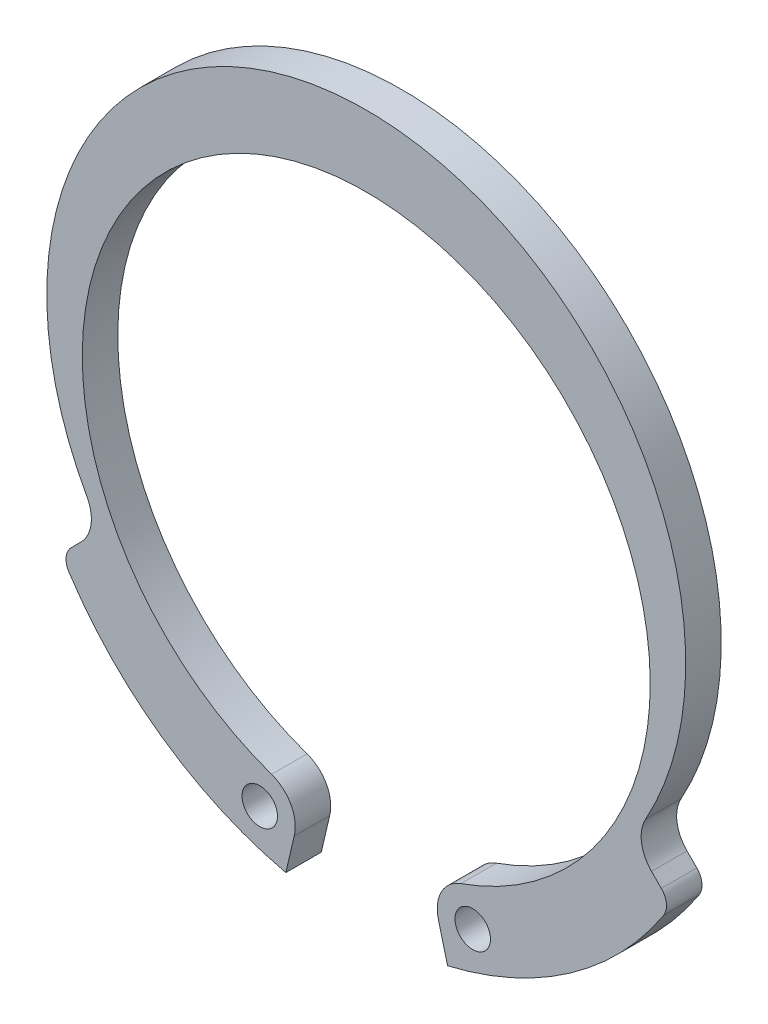
ISO-10303-21;
HEADER;
FILE_DESCRIPTION(('STEP AP214'),'2;1');
FILE_NAME('part.step','',(''),(''),'','','');
FILE_SCHEMA(('AUTOMOTIVE_DESIGN { 1 0 10303 214 1 1 1 1 }'));
ENDSEC;
DATA;
#1=APPLICATION_CONTEXT('core data for automotive mechanical design processes');
#2=APPLICATION_PROTOCOL_DEFINITION('international standard','automotive_design',2000,#1);
#3=PRODUCT_CONTEXT('',#1,'mechanical');
#4=PRODUCT('Part','Part','',(#3));
#5=PRODUCT_RELATED_PRODUCT_CATEGORY('part','',(#4));
#6=PRODUCT_DEFINITION_FORMATION('','',#4);
#7=PRODUCT_DEFINITION_CONTEXT('part definition',#1,'design');
#8=PRODUCT_DEFINITION('design','',#6,#7);
#9=PRODUCT_DEFINITION_SHAPE('','',#8);
#10=(LENGTH_UNIT() NAMED_UNIT(*) SI_UNIT(.MILLI.,.METRE.));
#11=(NAMED_UNIT(*) PLANE_ANGLE_UNIT() SI_UNIT($,.RADIAN.));
#12=(NAMED_UNIT(*) SI_UNIT($,.STERADIAN.) SOLID_ANGLE_UNIT());
#13=UNCERTAINTY_MEASURE_WITH_UNIT(LENGTH_MEASURE(1.E-05),#10,'distance_accuracy_value','');
#14=(GEOMETRIC_REPRESENTATION_CONTEXT(3) GLOBAL_UNCERTAINTY_ASSIGNED_CONTEXT((#13)) GLOBAL_UNIT_ASSIGNED_CONTEXT((#10,
#11,#12)) REPRESENTATION_CONTEXT('',''));
#15=CARTESIAN_POINT('',(0.,0.,0.));
#16=DIRECTION('',(0.,0.,1.));
#17=DIRECTION('',(1.,0.,0.));
#18=AXIS2_PLACEMENT_3D('',#15,#16,#17);
#19=CARTESIAN_POINT('',(-8.74391330389976,-4.85221394147917,1.));
#20=DIRECTION('',(0.,0.,1.));
#21=DIRECTION('',(1.,0.,0.));
#22=AXIS2_PLACEMENT_3D('',#19,#20,#21);
#23=PLANE('',#22);
#24=CARTESIAN_POINT('',(-3.,-9.48528137423857,1.));
#25=DIRECTION('',(0.,0.,1.));
#26=DIRECTION('',(1.,0.,0.));
#27=AXIS2_PLACEMENT_3D('',#24,#25,#26);
#28=CIRCLE('',#27,0.5);
#29=CARTESIAN_POINT('',(-2.5,-9.48528137423857,1.));
#30=VERTEX_POINT('',#29);
#31=EDGE_CURVE('E174',#30,#30,#28,.T.);
#32=ORIENTED_EDGE('',*,*,#31,.F.);
#33=EDGE_LOOP('',(#32));
#34=FACE_BOUND('',#33,.T.);
#35=CARTESIAN_POINT('',(-8.74391330389976,-4.85221394147917,1.));
#36=DIRECTION('',(0.,0.,-1.));
#37=DIRECTION('',(1.,0.,0.));
#38=AXIS2_PLACEMENT_3D('',#35,#36,#37);
#39=CIRCLE('',#38,1.);
#40=CARTESIAN_POINT('',(-7.86952197350978,-4.36699254733125,1.));
#41=VERTEX_POINT('',#40);
#42=CARTESIAN_POINT('',(-8.0368065227132,-5.55932072266571,1.));
#43=VERTEX_POINT('',#42);
#44=EDGE_CURVE('E197',#41,#43,#39,.T.);
#45=ORIENTED_EDGE('',*,*,#44,.T.);
#46=DIRECTION('',(-0.707106781186541,-0.707106781186554,0.));
#47=VECTOR('',#46,1.);
#48=CARTESIAN_POINT('',(-8.0368065227132,-5.55932072266571,1.));
#49=LINE('',#48,#47);
#50=CARTESIAN_POINT('',(-8.31188902824604,-5.83440322819855,1.));
#51=VERTEX_POINT('',#50);
#52=EDGE_CURVE('E115',#43,#51,#49,.T.);
#53=ORIENTED_EDGE('',*,*,#52,.T.);
#54=CARTESIAN_POINT('',(-7.95833563765277,-6.18795661879182,1.));
#55=DIRECTION('',(0.,0.,1.));
#56=DIRECTION('',(1.,0.,0.));
#57=AXIS2_PLACEMENT_3D('',#54,#55,#56);
#58=CIRCLE('',#57,0.500000000000001);
#59=CARTESIAN_POINT('',(-8.37719540805555,-6.46100696714929,1.));
#60=VERTEX_POINT('',#59);
#61=EDGE_CURVE('E230',#51,#60,#58,.T.);
#62=ORIENTED_EDGE('',*,*,#61,.T.);
#63=CARTESIAN_POINT('',(0.,-1.,1.));
#64=DIRECTION('',(0.,0.,1.));
#65=DIRECTION('',(1.,0.,0.));
#66=AXIS2_PLACEMENT_3D('',#63,#64,#65);
#67=CIRCLE('',#66,10.);
#68=CARTESIAN_POINT('',(-2.26550344127932,-10.7399945666079,1.));
#69=VERTEX_POINT('',#68);
#70=EDGE_CURVE('E249',#60,#69,#67,.T.);
#71=ORIENTED_EDGE('',*,*,#70,.T.);
#72=DIRECTION('',(0.226550344127932,0.973999456660791,0.));
#73=VECTOR('',#72,1.);
#74=CARTESIAN_POINT('',(-2.0322874859678,-9.73733789604567,1.));
#75=LINE('',#74,#73);
#76=CARTESIAN_POINT('',(-2.0322874859678,-9.73733789604567,1.));
#77=VERTEX_POINT('',#76);
#78=EDGE_CURVE('E246',#69,#77,#75,.T.);
#79=ORIENTED_EDGE('',*,*,#78,.T.);
#80=CARTESIAN_POINT('',(-3.,-9.48528137423857,1.));
#81=DIRECTION('',(0.,0.,1.));
#82=DIRECTION('',(1.,0.,0.));
#83=AXIS2_PLACEMENT_3D('',#80,#81,#82);
#84=CIRCLE('',#83,1.);
#85=CARTESIAN_POINT('',(-2.66666666666666,-8.54247233265651,1.));
#86=VERTEX_POINT('',#85);
#87=EDGE_CURVE('E248',#77,#86,#84,.T.);
#88=ORIENTED_EDGE('',*,*,#87,.T.);
#89=CARTESIAN_POINT('',(0.,-1.,1.));
#90=DIRECTION('',(0.,0.,-1.));
#91=DIRECTION('',(1.,0.,0.));
#92=AXIS2_PLACEMENT_3D('',#89,#90,#91);
#93=CIRCLE('',#92,8.);
#94=CARTESIAN_POINT('',(2.66666666666667,-8.54247233265651,1.));
#95=VERTEX_POINT('',#94);
#96=EDGE_CURVE('E251',#86,#95,#93,.T.);
#97=ORIENTED_EDGE('',*,*,#96,.T.);
#98=CARTESIAN_POINT('',(3.,-9.48528137423857,1.));
#99=DIRECTION('',(0.,0.,1.));
#100=DIRECTION('',(1.,0.,0.));
#101=AXIS2_PLACEMENT_3D('',#98,#99,#100);
#102=CIRCLE('',#101,1.);
#103=CARTESIAN_POINT('',(2.03228748596781,-9.73733789604567,1.));
#104=VERTEX_POINT('',#103);
#105=EDGE_CURVE('E257',#95,#104,#102,.T.);
#106=ORIENTED_EDGE('',*,*,#105,.T.);
#107=DIRECTION('',(0.252056521807098,-0.967712514032193,0.));
#108=VECTOR('',#107,1.);
#109=CARTESIAN_POINT('',(2.03228748596781,-9.73733789604567,1.));
#110=LINE('',#109,#108);
#111=CARTESIAN_POINT('',(2.29184040400694,-10.7338310835231,1.));
#112=VERTEX_POINT('',#111);
#113=EDGE_CURVE('E259',#104,#112,#110,.T.);
#114=ORIENTED_EDGE('',*,*,#113,.T.);
#115=CARTESIAN_POINT('',(0.,-1.,1.));
#116=DIRECTION('',(0.,0.,1.));
#117=DIRECTION('',(1.,0.,0.));
#118=AXIS2_PLACEMENT_3D('',#115,#116,#117);
#119=CIRCLE('',#118,10.);
#120=CARTESIAN_POINT('',(8.37719540805554,-6.46100696714929,1.));
#121=VERTEX_POINT('',#120);
#122=EDGE_CURVE('E261',#112,#121,#119,.T.);
#123=ORIENTED_EDGE('',*,*,#122,.T.);
#124=CARTESIAN_POINT('',(7.95833563765277,-6.18795661879183,1.));
#125=DIRECTION('',(0.,0.,1.));
#126=DIRECTION('',(-1.,0.,0.));
#127=AXIS2_PLACEMENT_3D('',#124,#125,#126);
#128=CIRCLE('',#127,0.5);
#129=CARTESIAN_POINT('',(8.31188902824605,-5.83440322819856,1.));
#130=VERTEX_POINT('',#129);
#131=EDGE_CURVE('E152',#121,#130,#128,.T.);
#132=ORIENTED_EDGE('',*,*,#131,.T.);
#133=DIRECTION('',(-0.707106781186542,0.707106781186553,0.));
#134=VECTOR('',#133,1.);
#135=CARTESIAN_POINT('',(8.0368065227132,-5.55932072266571,1.));
#136=LINE('',#135,#134);
#137=CARTESIAN_POINT('',(8.0368065227132,-5.55932072266571,1.));
#138=VERTEX_POINT('',#137);
#139=EDGE_CURVE('E146',#130,#138,#136,.T.);
#140=ORIENTED_EDGE('',*,*,#139,.T.);
#141=CARTESIAN_POINT('',(8.74391330389976,-4.85221394147916,1.));
#142=DIRECTION('',(0.,0.,-1.));
#143=DIRECTION('',(-1.,0.,0.));
#144=AXIS2_PLACEMENT_3D('',#141,#142,#143);
#145=CIRCLE('',#144,0.999999999999999);
#146=CARTESIAN_POINT('',(7.86952197350978,-4.36699254733125,1.));
#147=VERTEX_POINT('',#146);
#148=EDGE_CURVE('E150',#138,#147,#145,.T.);
#149=ORIENTED_EDGE('',*,*,#148,.T.);
#150=CARTESIAN_POINT('',(0.,0.,1.));
#151=DIRECTION('',(0.,0.,1.));
#152=DIRECTION('',(1.,0.,0.));
#153=AXIS2_PLACEMENT_3D('',#150,#151,#152);
#154=CIRCLE('',#153,9.);
#155=EDGE_CURVE('E54',#147,#41,#154,.T.);
#156=ORIENTED_EDGE('',*,*,#155,.T.);
#157=EDGE_LOOP('',(#45,#53,#62,#71,#79,#88,#97,#106,#114,#123,#132,#140,#149,#156));
#158=FACE_BOUND('',#157,.T.);
#159=CARTESIAN_POINT('',(3.,-9.48528137423857,1.));
#160=DIRECTION('',(0.,0.,1.));
#161=DIRECTION('',(1.,0.,0.));
#162=AXIS2_PLACEMENT_3D('',#159,#160,#161);
#163=CIRCLE('',#162,0.5);
#164=CARTESIAN_POINT('',(3.5,-9.48528137423857,1.));
#165=VERTEX_POINT('',#164);
#166=EDGE_CURVE('E303',#165,#165,#163,.T.);
#167=ORIENTED_EDGE('',*,*,#166,.F.);
#168=EDGE_LOOP('',(#167));
#169=FACE_BOUND('',#168,.T.);
#170=ADVANCED_FACE('F37',(#34,#158,#169),#23,.T.);
#171=CARTESIAN_POINT('',(-8.74391330389976,-4.85221394147917,0.));
#172=DIRECTION('',(0.,0.,1.));
#173=DIRECTION('',(1.,0.,0.));
#174=AXIS2_PLACEMENT_3D('',#171,#172,#173);
#175=PLANE('',#174);
#176=CARTESIAN_POINT('',(-8.74391330389976,-4.85221394147917,0.));
#177=DIRECTION('',(0.,0.,-1.));
#178=DIRECTION('',(1.,0.,0.));
#179=AXIS2_PLACEMENT_3D('',#176,#177,#178);
#180=CIRCLE('',#179,1.);
#181=CARTESIAN_POINT('',(-7.86952197350978,-4.36699254733125,0.));
#182=VERTEX_POINT('',#181);
#183=CARTESIAN_POINT('',(-8.0368065227132,-5.55932072266571,0.));
#184=VERTEX_POINT('',#183);
#185=EDGE_CURVE('E170',#182,#184,#180,.T.);
#186=ORIENTED_EDGE('',*,*,#185,.F.);
#187=CARTESIAN_POINT('',(0.,0.,0.));
#188=DIRECTION('',(0.,0.,1.));
#189=DIRECTION('',(1.,0.,0.));
#190=AXIS2_PLACEMENT_3D('',#187,#188,#189);
#191=CIRCLE('',#190,9.);
#192=CARTESIAN_POINT('',(7.86952197350978,-4.36699254733125,0.));
#193=VERTEX_POINT('',#192);
#194=EDGE_CURVE('E107',#193,#182,#191,.T.);
#195=ORIENTED_EDGE('',*,*,#194,.F.);
#196=CARTESIAN_POINT('',(8.74391330389976,-4.85221394147916,0.));
#197=DIRECTION('',(0.,0.,-1.));
#198=DIRECTION('',(-1.,0.,0.));
#199=AXIS2_PLACEMENT_3D('',#196,#197,#198);
#200=CIRCLE('',#199,0.999999999999999);
#201=CARTESIAN_POINT('',(8.0368065227132,-5.55932072266571,0.));
#202=VERTEX_POINT('',#201);
#203=EDGE_CURVE('E101',#202,#193,#200,.T.);
#204=ORIENTED_EDGE('',*,*,#203,.F.);
#205=DIRECTION('',(-0.707106781186542,0.707106781186553,0.));
#206=VECTOR('',#205,1.);
#207=CARTESIAN_POINT('',(8.0368065227132,-5.55932072266571,0.));
#208=LINE('',#207,#206);
#209=CARTESIAN_POINT('',(8.31188902824605,-5.83440322819856,0.));
#210=VERTEX_POINT('',#209);
#211=EDGE_CURVE('E160',#210,#202,#208,.T.);
#212=ORIENTED_EDGE('',*,*,#211,.F.);
#213=CARTESIAN_POINT('',(7.95833563765277,-6.18795661879183,0.));
#214=DIRECTION('',(0.,0.,1.));
#215=DIRECTION('',(-1.,0.,0.));
#216=AXIS2_PLACEMENT_3D('',#213,#214,#215);
#217=CIRCLE('',#216,0.5);
#218=CARTESIAN_POINT('',(8.37719540805554,-6.46100696714929,0.));
#219=VERTEX_POINT('',#218);
#220=EDGE_CURVE('E192',#219,#210,#217,.T.);
#221=ORIENTED_EDGE('',*,*,#220,.F.);
#222=CARTESIAN_POINT('',(0.,-1.,0.));
#223=DIRECTION('',(0.,0.,1.));
#224=DIRECTION('',(1.,0.,0.));
#225=AXIS2_PLACEMENT_3D('',#222,#223,#224);
#226=CIRCLE('',#225,10.);
#227=CARTESIAN_POINT('',(2.29184040400694,-10.7338310835231,0.));
#228=VERTEX_POINT('',#227);
#229=EDGE_CURVE('E190',#228,#219,#226,.T.);
#230=ORIENTED_EDGE('',*,*,#229,.F.);
#231=DIRECTION('',(0.252056521807098,-0.967712514032193,0.));
#232=VECTOR('',#231,1.);
#233=CARTESIAN_POINT('',(2.03228748596781,-9.73733789604567,0.));
#234=LINE('',#233,#232);
#235=CARTESIAN_POINT('',(2.03228748596781,-9.73733789604567,0.));
#236=VERTEX_POINT('',#235);
#237=EDGE_CURVE('E188',#236,#228,#234,.T.);
#238=ORIENTED_EDGE('',*,*,#237,.F.);
#239=CARTESIAN_POINT('',(3.,-9.48528137423857,0.));
#240=DIRECTION('',(0.,0.,1.));
#241=DIRECTION('',(1.,0.,0.));
#242=AXIS2_PLACEMENT_3D('',#239,#240,#241);
#243=CIRCLE('',#242,1.);
#244=CARTESIAN_POINT('',(2.66666666666667,-8.54247233265651,0.));
#245=VERTEX_POINT('',#244);
#246=EDGE_CURVE('E186',#245,#236,#243,.T.);
#247=ORIENTED_EDGE('',*,*,#246,.F.);
#248=CARTESIAN_POINT('',(0.,-1.,0.));
#249=DIRECTION('',(0.,0.,-1.));
#250=DIRECTION('',(1.,0.,0.));
#251=AXIS2_PLACEMENT_3D('',#248,#249,#250);
#252=CIRCLE('',#251,8.);
#253=CARTESIAN_POINT('',(-2.66666666666666,-8.54247233265651,0.));
#254=VERTEX_POINT('',#253);
#255=EDGE_CURVE('E184',#254,#245,#252,.T.);
#256=ORIENTED_EDGE('',*,*,#255,.F.);
#257=CARTESIAN_POINT('',(-3.,-9.48528137423857,0.));
#258=DIRECTION('',(0.,0.,1.));
#259=DIRECTION('',(1.,0.,0.));
#260=AXIS2_PLACEMENT_3D('',#257,#258,#259);
#261=CIRCLE('',#260,1.);
#262=CARTESIAN_POINT('',(-2.0322874859678,-9.73733789604567,0.));
#263=VERTEX_POINT('',#262);
#264=EDGE_CURVE('E182',#263,#254,#261,.T.);
#265=ORIENTED_EDGE('',*,*,#264,.F.);
#266=DIRECTION('',(0.226550344127932,0.973999456660791,0.));
#267=VECTOR('',#266,1.);
#268=CARTESIAN_POINT('',(-2.0322874859678,-9.73733789604567,0.));
#269=LINE('',#268,#267);
#270=CARTESIAN_POINT('',(-2.26550344127932,-10.7399945666079,0.));
#271=VERTEX_POINT('',#270);
#272=EDGE_CURVE('E180',#271,#263,#269,.T.);
#273=ORIENTED_EDGE('',*,*,#272,.F.);
#274=CARTESIAN_POINT('',(0.,-1.,0.));
#275=DIRECTION('',(0.,0.,1.));
#276=DIRECTION('',(1.,0.,0.));
#277=AXIS2_PLACEMENT_3D('',#274,#275,#276);
#278=CIRCLE('',#277,10.);
#279=CARTESIAN_POINT('',(-8.37719540805555,-6.46100696714929,0.));
#280=VERTEX_POINT('',#279);
#281=EDGE_CURVE('E178',#280,#271,#278,.T.);
#282=ORIENTED_EDGE('',*,*,#281,.F.);
#283=CARTESIAN_POINT('',(-7.95833563765277,-6.18795661879182,0.));
#284=DIRECTION('',(0.,0.,1.));
#285=DIRECTION('',(1.,0.,0.));
#286=AXIS2_PLACEMENT_3D('',#283,#284,#285);
#287=CIRCLE('',#286,0.500000000000001);
#288=CARTESIAN_POINT('',(-8.31188902824604,-5.83440322819855,0.));
#289=VERTEX_POINT('',#288);
#290=EDGE_CURVE('E176',#289,#280,#287,.T.);
#291=ORIENTED_EDGE('',*,*,#290,.F.);
#292=DIRECTION('',(-0.707106781186541,-0.707106781186554,0.));
#293=VECTOR('',#292,1.);
#294=CARTESIAN_POINT('',(-8.0368065227132,-5.55932072266571,0.));
#295=LINE('',#294,#293);
#296=EDGE_CURVE('E173',#184,#289,#295,.T.);
#297=ORIENTED_EDGE('',*,*,#296,.F.);
#298=EDGE_LOOP('',(#186,#195,#204,#212,#221,#230,#238,#247,#256,#265,#273,#282,#291,#297));
#299=FACE_BOUND('',#298,.T.);
#300=CARTESIAN_POINT('',(-3.,-9.48528137423857,0.));
#301=DIRECTION('',(0.,0.,1.));
#302=DIRECTION('',(1.,0.,0.));
#303=AXIS2_PLACEMENT_3D('',#300,#301,#302);
#304=CIRCLE('',#303,0.5);
#305=CARTESIAN_POINT('',(-2.5,-9.48528137423857,0.));
#306=VERTEX_POINT('',#305);
#307=EDGE_CURVE('E309',#306,#306,#304,.T.);
#308=ORIENTED_EDGE('',*,*,#307,.T.);
#309=EDGE_LOOP('',(#308));
#310=FACE_BOUND('',#309,.T.);
#311=CARTESIAN_POINT('',(3.,-9.48528137423857,0.));
#312=DIRECTION('',(0.,0.,1.));
#313=DIRECTION('',(1.,0.,0.));
#314=AXIS2_PLACEMENT_3D('',#311,#312,#313);
#315=CIRCLE('',#314,0.5);
#316=CARTESIAN_POINT('',(3.5,-9.48528137423857,0.));
#317=VERTEX_POINT('',#316);
#318=EDGE_CURVE('E306',#317,#317,#315,.T.);
#319=ORIENTED_EDGE('',*,*,#318,.T.);
#320=EDGE_LOOP('',(#319));
#321=FACE_BOUND('',#320,.T.);
#322=ADVANCED_FACE('F234',(#299,#310,#321),#175,.F.);
#323=CARTESIAN_POINT('',(-8.74391330389976,-4.85221394147917,1.));
#324=DIRECTION('',(0.,0.,-1.));
#325=DIRECTION('',(-1.,0.,0.));
#326=AXIS2_PLACEMENT_3D('',#323,#324,#325);
#327=CYLINDRICAL_SURFACE('',#326,1.);
#328=ORIENTED_EDGE('',*,*,#185,.T.);
#329=DIRECTION('',(0.,0.,-1.));
#330=VECTOR('',#329,1.);
#331=CARTESIAN_POINT('',(-8.0368065227132,-5.55932072266571,1.));
#332=LINE('',#331,#330);
#333=EDGE_CURVE('E11',#43,#184,#332,.T.);
#334=ORIENTED_EDGE('',*,*,#333,.F.);
#335=ORIENTED_EDGE('',*,*,#44,.F.);
#336=DIRECTION('',(0.,0.,-1.));
#337=VECTOR('',#336,1.);
#338=CARTESIAN_POINT('',(-7.86952197350978,-4.36699254733125,1.));
#339=LINE('',#338,#337);
#340=EDGE_CURVE('E166',#41,#182,#339,.T.);
#341=ORIENTED_EDGE('',*,*,#340,.T.);
#342=EDGE_LOOP('',(#328,#334,#335,#341));
#343=FACE_BOUND('',#342,.T.);
#344=ADVANCED_FACE('F39',(#343),#327,.F.);
#345=CARTESIAN_POINT('',(-8.0368065227132,-5.55932072266571,1.));
#346=DIRECTION('',(0.707106781186554,-0.707106781186541,0.));
#347=DIRECTION('',(0.707106781186541,0.707106781186554,0.));
#348=AXIS2_PLACEMENT_3D('',#345,#346,#347);
#349=PLANE('',#348);
#350=ORIENTED_EDGE('',*,*,#296,.T.);
#351=DIRECTION('',(0.,0.,-1.));
#352=VECTOR('',#351,1.);
#353=CARTESIAN_POINT('',(-8.31188902824604,-5.83440322819855,1.));
#354=LINE('',#353,#352);
#355=EDGE_CURVE('E46',#51,#289,#354,.T.);
#356=ORIENTED_EDGE('',*,*,#355,.F.);
#357=ORIENTED_EDGE('',*,*,#52,.F.);
#358=ORIENTED_EDGE('',*,*,#333,.T.);
#359=EDGE_LOOP('',(#350,#356,#357,#358));
#360=FACE_BOUND('',#359,.T.);
#361=ADVANCED_FACE('F434',(#360),#349,.F.);
#362=CARTESIAN_POINT('',(-7.95833563765277,-6.18795661879182,1.));
#363=DIRECTION('',(0.,0.,-1.));
#364=DIRECTION('',(-1.,0.,0.));
#365=AXIS2_PLACEMENT_3D('',#362,#363,#364);
#366=CYLINDRICAL_SURFACE('',#365,0.500000000000001);
#367=ORIENTED_EDGE('',*,*,#290,.T.);
#368=DIRECTION('',(0.,0.,-1.));
#369=VECTOR('',#368,1.);
#370=CARTESIAN_POINT('',(-8.37719540805555,-6.46100696714929,1.));
#371=LINE('',#370,#369);
#372=EDGE_CURVE('E222',#60,#280,#371,.T.);
#373=ORIENTED_EDGE('',*,*,#372,.F.);
#374=ORIENTED_EDGE('',*,*,#61,.F.);
#375=ORIENTED_EDGE('',*,*,#355,.T.);
#376=EDGE_LOOP('',(#367,#373,#374,#375));
#377=FACE_BOUND('',#376,.T.);
#378=ADVANCED_FACE('F228',(#377),#366,.T.);
#379=CARTESIAN_POINT('',(0.,-1.,1.));
#380=DIRECTION('',(0.,0.,-1.));
#381=DIRECTION('',(-1.,0.,0.));
#382=AXIS2_PLACEMENT_3D('',#379,#380,#381);
#383=CYLINDRICAL_SURFACE('',#382,10.);
#384=ORIENTED_EDGE('',*,*,#281,.T.);
#385=DIRECTION('',(0.,0.,-1.));
#386=VECTOR('',#385,1.);
#387=CARTESIAN_POINT('',(-2.26550344127932,-10.7399945666079,1.));
#388=LINE('',#387,#386);
#389=EDGE_CURVE('E219',#69,#271,#388,.T.);
#390=ORIENTED_EDGE('',*,*,#389,.F.);
#391=ORIENTED_EDGE('',*,*,#70,.F.);
#392=ORIENTED_EDGE('',*,*,#372,.T.);
#393=EDGE_LOOP('',(#384,#390,#391,#392));
#394=FACE_BOUND('',#393,.T.);
#395=ADVANCED_FACE('F240',(#394),#383,.T.);
#396=CARTESIAN_POINT('',(-2.0322874859678,-9.73733789604567,1.));
#397=DIRECTION('',(-0.973999456660791,0.226550344127932,0.));
#398=DIRECTION('',(-0.226550344127932,-0.973999456660791,0.));
#399=AXIS2_PLACEMENT_3D('',#396,#397,#398);
#400=PLANE('',#399);
#401=ORIENTED_EDGE('',*,*,#272,.T.);
#402=DIRECTION('',(0.,0.,-1.));
#403=VECTOR('',#402,1.);
#404=CARTESIAN_POINT('',(-2.0322874859678,-9.73733789604567,1.));
#405=LINE('',#404,#403);
#406=EDGE_CURVE('E216',#77,#263,#405,.T.);
#407=ORIENTED_EDGE('',*,*,#406,.F.);
#408=ORIENTED_EDGE('',*,*,#78,.F.);
#409=ORIENTED_EDGE('',*,*,#389,.T.);
#410=EDGE_LOOP('',(#401,#407,#408,#409));
#411=FACE_BOUND('',#410,.T.);
#412=ADVANCED_FACE('F244',(#411),#400,.F.);
#413=CARTESIAN_POINT('',(-3.,-9.48528137423857,1.));
#414=DIRECTION('',(0.,0.,-1.));
#415=DIRECTION('',(-1.,0.,0.));
#416=AXIS2_PLACEMENT_3D('',#413,#414,#415);
#417=CYLINDRICAL_SURFACE('',#416,1.);
#418=ORIENTED_EDGE('',*,*,#264,.T.);
#419=DIRECTION('',(0.,0.,-1.));
#420=VECTOR('',#419,1.);
#421=CARTESIAN_POINT('',(-2.66666666666666,-8.54247233265651,1.));
#422=LINE('',#421,#420);
#423=EDGE_CURVE('E213',#86,#254,#422,.T.);
#424=ORIENTED_EDGE('',*,*,#423,.F.);
#425=ORIENTED_EDGE('',*,*,#87,.F.);
#426=ORIENTED_EDGE('',*,*,#406,.T.);
#427=EDGE_LOOP('',(#418,#424,#425,#426));
#428=FACE_BOUND('',#427,.T.);
#429=ADVANCED_FACE('F395',(#428),#417,.T.);
#430=CARTESIAN_POINT('',(0.,-1.,1.));
#431=DIRECTION('',(0.,0.,-1.));
#432=DIRECTION('',(-1.,0.,0.));
#433=AXIS2_PLACEMENT_3D('',#430,#431,#432);
#434=CYLINDRICAL_SURFACE('',#433,8.);
#435=ORIENTED_EDGE('',*,*,#255,.T.);
#436=DIRECTION('',(0.,0.,-1.));
#437=VECTOR('',#436,1.);
#438=CARTESIAN_POINT('',(2.66666666666667,-8.54247233265651,1.));
#439=LINE('',#438,#437);
#440=EDGE_CURVE('E210',#95,#245,#439,.T.);
#441=ORIENTED_EDGE('',*,*,#440,.F.);
#442=ORIENTED_EDGE('',*,*,#96,.F.);
#443=ORIENTED_EDGE('',*,*,#423,.T.);
#444=EDGE_LOOP('',(#435,#441,#442,#443));
#445=FACE_BOUND('',#444,.T.);
#446=ADVANCED_FACE('F384',(#445),#434,.F.);
#447=CARTESIAN_POINT('',(3.,-9.48528137423857,1.));
#448=DIRECTION('',(0.,0.,-1.));
#449=DIRECTION('',(-1.,0.,0.));
#450=AXIS2_PLACEMENT_3D('',#447,#448,#449);
#451=CYLINDRICAL_SURFACE('',#450,1.);
#452=ORIENTED_EDGE('',*,*,#246,.T.);
#453=DIRECTION('',(0.,0.,-1.));
#454=VECTOR('',#453,1.);
#455=CARTESIAN_POINT('',(2.03228748596781,-9.73733789604567,1.));
#456=LINE('',#455,#454);
#457=EDGE_CURVE('E207',#104,#236,#456,.T.);
#458=ORIENTED_EDGE('',*,*,#457,.F.);
#459=ORIENTED_EDGE('',*,*,#105,.F.);
#460=ORIENTED_EDGE('',*,*,#440,.T.);
#461=EDGE_LOOP('',(#452,#458,#459,#460));
#462=FACE_BOUND('',#461,.T.);
#463=ADVANCED_FACE('F373',(#462),#451,.T.);
#464=CARTESIAN_POINT('',(2.03228748596781,-9.73733789604567,1.));
#465=DIRECTION('',(0.967712514032194,0.252056521807098,0.));
#466=DIRECTION('',(-0.252056521807098,0.967712514032193,0.));
#467=AXIS2_PLACEMENT_3D('',#464,#465,#466);
#468=PLANE('',#467);
#469=ORIENTED_EDGE('',*,*,#237,.T.);
#470=DIRECTION('',(0.,0.,-1.));
#471=VECTOR('',#470,1.);
#472=CARTESIAN_POINT('',(2.29184040400694,-10.7338310835231,1.));
#473=LINE('',#472,#471);
#474=EDGE_CURVE('E204',#112,#228,#473,.T.);
#475=ORIENTED_EDGE('',*,*,#474,.F.);
#476=ORIENTED_EDGE('',*,*,#113,.F.);
#477=ORIENTED_EDGE('',*,*,#457,.T.);
#478=EDGE_LOOP('',(#469,#475,#476,#477));
#479=FACE_BOUND('',#478,.T.);
#480=ADVANCED_FACE('F363',(#479),#468,.F.);
#481=CARTESIAN_POINT('',(0.,-1.,1.));
#482=DIRECTION('',(0.,0.,-1.));
#483=DIRECTION('',(-1.,0.,0.));
#484=AXIS2_PLACEMENT_3D('',#481,#482,#483);
#485=CYLINDRICAL_SURFACE('',#484,10.);
#486=ORIENTED_EDGE('',*,*,#229,.T.);
#487=DIRECTION('',(0.,0.,-1.));
#488=VECTOR('',#487,1.);
#489=CARTESIAN_POINT('',(8.37719540805554,-6.46100696714929,1.));
#490=LINE('',#489,#488);
#491=EDGE_CURVE('E201',#121,#219,#490,.T.);
#492=ORIENTED_EDGE('',*,*,#491,.F.);
#493=ORIENTED_EDGE('',*,*,#122,.F.);
#494=ORIENTED_EDGE('',*,*,#474,.T.);
#495=EDGE_LOOP('',(#486,#492,#493,#494));
#496=FACE_BOUND('',#495,.T.);
#497=ADVANCED_FACE('F267',(#496),#485,.T.);
#498=CARTESIAN_POINT('',(7.95833563765277,-6.18795661879183,1.));
#499=DIRECTION('',(0.,0.,-1.));
#500=DIRECTION('',(-1.,0.,0.));
#501=AXIS2_PLACEMENT_3D('',#498,#499,#500);
#502=CYLINDRICAL_SURFACE('',#501,0.5);
#503=ORIENTED_EDGE('',*,*,#220,.T.);
#504=DIRECTION('',(0.,0.,-1.));
#505=VECTOR('',#504,1.);
#506=CARTESIAN_POINT('',(8.31188902824605,-5.83440322819856,1.));
#507=LINE('',#506,#505);
#508=EDGE_CURVE('E161',#130,#210,#507,.T.);
#509=ORIENTED_EDGE('',*,*,#508,.F.);
#510=ORIENTED_EDGE('',*,*,#131,.F.);
#511=ORIENTED_EDGE('',*,*,#491,.T.);
#512=EDGE_LOOP('',(#503,#509,#510,#511));
#513=FACE_BOUND('',#512,.T.);
#514=ADVANCED_FACE('F271',(#513),#502,.T.);
#515=CARTESIAN_POINT('',(8.0368065227132,-5.55932072266571,1.));
#516=DIRECTION('',(-0.707106781186553,-0.707106781186542,0.));
#517=DIRECTION('',(0.707106781186542,-0.707106781186553,0.));
#518=AXIS2_PLACEMENT_3D('',#515,#516,#517);
#519=PLANE('',#518);
#520=ORIENTED_EDGE('',*,*,#211,.T.);
#521=DIRECTION('',(0.,0.,-1.));
#522=VECTOR('',#521,1.);
#523=CARTESIAN_POINT('',(8.0368065227132,-5.55932072266571,1.));
#524=LINE('',#523,#522);
#525=EDGE_CURVE('E157',#138,#202,#524,.T.);
#526=ORIENTED_EDGE('',*,*,#525,.F.);
#527=ORIENTED_EDGE('',*,*,#139,.F.);
#528=ORIENTED_EDGE('',*,*,#508,.T.);
#529=EDGE_LOOP('',(#520,#526,#527,#528));
#530=FACE_BOUND('',#529,.T.);
#531=ADVANCED_FACE('F158',(#530),#519,.F.);
#532=CARTESIAN_POINT('',(8.74391330389976,-4.85221394147916,1.));
#533=DIRECTION('',(0.,0.,-1.));
#534=DIRECTION('',(-1.,0.,0.));
#535=AXIS2_PLACEMENT_3D('',#532,#533,#534);
#536=CYLINDRICAL_SURFACE('',#535,0.999999999999999);
#537=ORIENTED_EDGE('',*,*,#203,.T.);
#538=DIRECTION('',(0.,0.,-1.));
#539=VECTOR('',#538,1.);
#540=CARTESIAN_POINT('',(7.86952197350978,-4.36699254733125,1.));
#541=LINE('',#540,#539);
#542=EDGE_CURVE('E162',#147,#193,#541,.T.);
#543=ORIENTED_EDGE('',*,*,#542,.F.);
#544=ORIENTED_EDGE('',*,*,#148,.F.);
#545=ORIENTED_EDGE('',*,*,#525,.T.);
#546=EDGE_LOOP('',(#537,#543,#544,#545));
#547=FACE_BOUND('',#546,.T.);
#548=ADVANCED_FACE('F164',(#547),#536,.F.);
#549=CARTESIAN_POINT('',(0.,0.,1.));
#550=DIRECTION('',(0.,0.,-1.));
#551=DIRECTION('',(-1.,0.,0.));
#552=AXIS2_PLACEMENT_3D('',#549,#550,#551);
#553=CYLINDRICAL_SURFACE('',#552,9.);
#554=ORIENTED_EDGE('',*,*,#194,.T.);
#555=ORIENTED_EDGE('',*,*,#340,.F.);
#556=ORIENTED_EDGE('',*,*,#155,.F.);
#557=ORIENTED_EDGE('',*,*,#542,.T.);
#558=EDGE_LOOP('',(#554,#555,#556,#557));
#559=FACE_BOUND('',#558,.T.);
#560=ADVANCED_FACE('F275',(#559),#553,.T.);
#561=CARTESIAN_POINT('',(-3.,-9.48528137423857,1.));
#562=DIRECTION('',(0.,0.,-1.));
#563=DIRECTION('',(-1.,0.,0.));
#564=AXIS2_PLACEMENT_3D('',#561,#562,#563);
#565=CYLINDRICAL_SURFACE('',#564,0.5);
#566=ORIENTED_EDGE('',*,*,#31,.T.);
#567=EDGE_LOOP('',(#566));
#568=FACE_BOUND('',#567,.T.);
#569=ORIENTED_EDGE('',*,*,#307,.F.);
#570=EDGE_LOOP('',(#569));
#571=FACE_BOUND('',#570,.T.);
#572=ADVANCED_FACE('F277',(#568,#571),#565,.F.);
#573=CARTESIAN_POINT('',(3.,-9.48528137423857,1.));
#574=DIRECTION('',(0.,0.,-1.));
#575=DIRECTION('',(-1.,0.,0.));
#576=AXIS2_PLACEMENT_3D('',#573,#574,#575);
#577=CYLINDRICAL_SURFACE('',#576,0.5);
#578=ORIENTED_EDGE('',*,*,#166,.T.);
#579=EDGE_LOOP('',(#578));
#580=FACE_BOUND('',#579,.T.);
#581=ORIENTED_EDGE('',*,*,#318,.F.);
#582=EDGE_LOOP('',(#581));
#583=FACE_BOUND('',#582,.T.);
#584=ADVANCED_FACE('F283',(#580,#583),#577,.F.);
#585=CLOSED_SHELL('',(#170,#322,#344,#361,#378,#395,#412,#429,#446,#463,#480,#497,#514,#531,
#548,#560,#572,#584));
#586=MANIFOLD_SOLID_BREP('B2',#585);
#587=ADVANCED_BREP_SHAPE_REPRESENTATION('',(#18,#586),#14);
#588=SHAPE_DEFINITION_REPRESENTATION(#9,#587);
ENDSEC;
END-ISO-10303-21;
